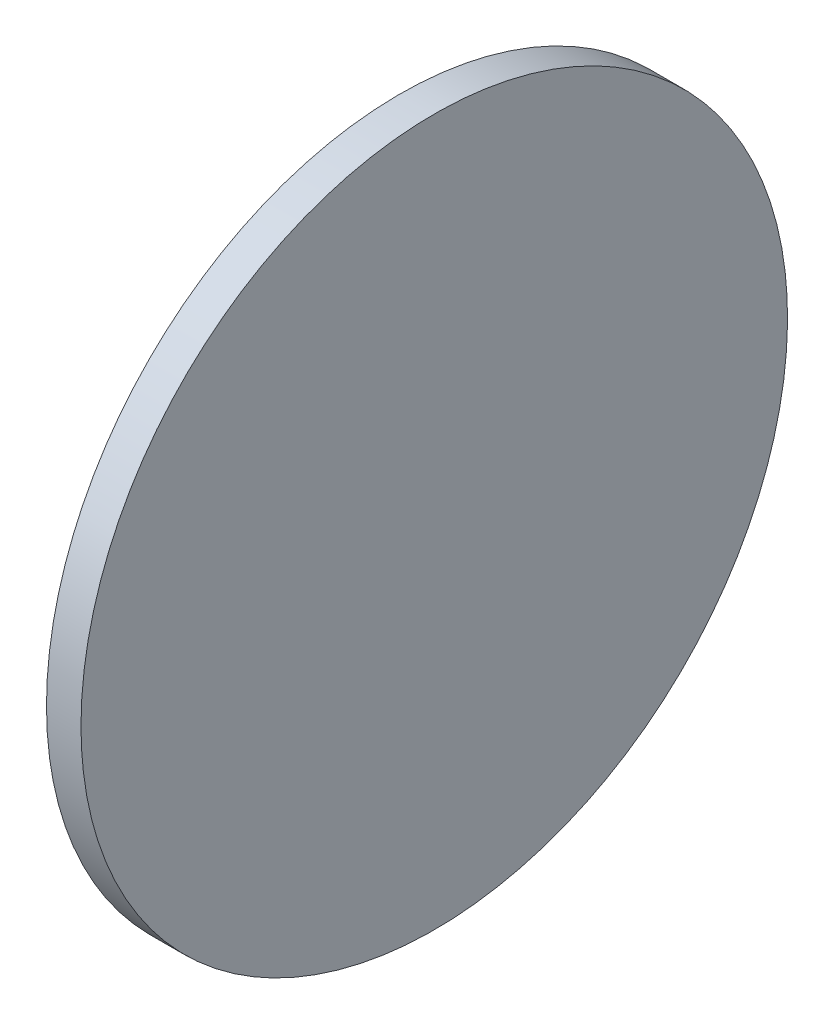
ISO-10303-21;
HEADER;
FILE_DESCRIPTION(('STEP AP214'),'2;1');
FILE_NAME('part.step','',(''),(''),'','','');
FILE_SCHEMA(('AUTOMOTIVE_DESIGN { 1 0 10303 214 1 1 1 1 }'));
ENDSEC;
DATA;
#1=APPLICATION_CONTEXT('core data for automotive mechanical design processes');
#2=APPLICATION_PROTOCOL_DEFINITION('international standard','automotive_design',2000,#1);
#3=PRODUCT_CONTEXT('',#1,'mechanical');
#4=PRODUCT('Part','Part','',(#3));
#5=PRODUCT_RELATED_PRODUCT_CATEGORY('part','',(#4));
#6=PRODUCT_DEFINITION_FORMATION('','',#4);
#7=PRODUCT_DEFINITION_CONTEXT('part definition',#1,'design');
#8=PRODUCT_DEFINITION('design','',#6,#7);
#9=PRODUCT_DEFINITION_SHAPE('','',#8);
#10=(LENGTH_UNIT() NAMED_UNIT(*) SI_UNIT(.MILLI.,.METRE.));
#11=(NAMED_UNIT(*) PLANE_ANGLE_UNIT() SI_UNIT($,.RADIAN.));
#12=(NAMED_UNIT(*) SI_UNIT($,.STERADIAN.) SOLID_ANGLE_UNIT());
#13=UNCERTAINTY_MEASURE_WITH_UNIT(LENGTH_MEASURE(1.E-05),#10,'distance_accuracy_value','');
#14=(GEOMETRIC_REPRESENTATION_CONTEXT(3) GLOBAL_UNCERTAINTY_ASSIGNED_CONTEXT((#13)) GLOBAL_UNIT_ASSIGNED_CONTEXT((#10,
#11,#12)) REPRESENTATION_CONTEXT('',''));
#15=CARTESIAN_POINT('',(0.,0.,0.));
#16=DIRECTION('',(0.,0.,1.));
#17=DIRECTION('',(1.,0.,0.));
#18=AXIS2_PLACEMENT_3D('',#15,#16,#17);
#19=CARTESIAN_POINT('',(-57.7008114631247,-10.1015554934087,30.2828427124814));
#20=CARTESIAN_POINT('',(-57.7008114631247,-9.42855059459681,30.2828427124814));
#21=CARTESIAN_POINT('',(-57.7008114631247,-8.08254079697294,30.150272318581));
#22=CARTESIAN_POINT('',(-57.7008114631247,-6.14111570304469,29.5613474548658));
#23=CARTESIAN_POINT('',(-57.7008114631247,-4.3518880892199,28.6049853705257));
#24=CARTESIAN_POINT('',(-57.7008114631247,-2.78361696928747,27.3179385241281));
#25=CARTESIAN_POINT('',(-57.7008114631247,-1.49657012288981,25.7496674041957));
#26=CARTESIAN_POINT('',(-57.7008114631247,-0.540208038549796,23.9604397903709));
#27=CARTESIAN_POINT('',(-57.7008114631247,0.0487168251654114,22.0190146964426));
#28=CARTESIAN_POINT('',(-57.7008114631247,0.247572416016112,20.0000000000068));
#29=CARTESIAN_POINT('',(-57.7008114631247,0.0487168251654121,17.980985303571));
#30=CARTESIAN_POINT('',(-57.7008114631247,-0.540208038549797,16.0395602096428));
#31=CARTESIAN_POINT('',(-57.7008114631247,-1.49657012288981,14.250332595818));
#32=CARTESIAN_POINT('',(-57.7008114631247,-2.78361696928747,12.6820614758856));
#33=CARTESIAN_POINT('',(-57.7008114631247,-4.3518880892199,11.3950146294879));
#34=CARTESIAN_POINT('',(-57.7008114631247,-6.14111570304469,10.4386525451479));
#35=CARTESIAN_POINT('',(-57.7008114631247,-8.08254079697294,9.84972768143268));
#36=CARTESIAN_POINT('',(-57.7008114631247,-10.1015554934087,9.65087209058198));
#37=CARTESIAN_POINT('',(-57.7008114631247,-12.1205701898445,9.84972768143268));
#38=CARTESIAN_POINT('',(-57.7008114631247,-14.0619952837728,10.4386525451479));
#39=CARTESIAN_POINT('',(-57.7008114631247,-15.8512228975976,11.3950146294879));
#40=CARTESIAN_POINT('',(-57.7008114631247,-17.41949401753,12.6820614758856));
#41=CARTESIAN_POINT('',(-57.7008114631247,-18.7065408639277,14.250332595818));
#42=CARTESIAN_POINT('',(-57.7008114631247,-19.6629029482677,16.0395602096428));
#43=CARTESIAN_POINT('',(-57.7008114631247,-20.2518278119829,17.980985303571));
#44=CARTESIAN_POINT('',(-57.7008114631247,-20.4506834028336,20.0000000000068));
#45=CARTESIAN_POINT('',(-57.7008114631247,-20.2518278119829,22.0190146964426));
#46=CARTESIAN_POINT('',(-57.7008114631247,-19.6629029482677,23.9604397903709));
#47=CARTESIAN_POINT('',(-57.7008114631247,-18.7065408639277,25.7496674041956));
#48=CARTESIAN_POINT('',(-57.7008114631247,-17.41949401753,27.3179385241281));
#49=CARTESIAN_POINT('',(-57.7008114631247,-15.8512228975976,28.6049853705257));
#50=CARTESIAN_POINT('',(-57.7008114631247,-14.0619952837728,29.5613474548658));
#51=CARTESIAN_POINT('',(-57.7008114631247,-12.1205701898445,30.150272318581));
#52=CARTESIAN_POINT('',(-57.7008114631247,-10.7745603922207,30.2828427124814));
#53=CARTESIAN_POINT('',(-57.7008114631247,-10.1015554934087,30.2828427124814));
#54=B_SPLINE_CURVE_WITH_KNOTS('',3,(#19,#20,#21,#22,#23,#24,#25,#26,#27,#28,#29,#30,#31,#32,#33,
#34,#35,#36,#37,#38,#39,#40,#41,#42,#43,#44,#45,#46,#47,#48,#49,#50,#51,#52,#53),.UNSPECIFIED.,
.T.,.F.,(4,1,1,1,1,1,1,1,1,1,1,1,1,1,1,1,1,1,1,1,1,1,1,1,1,1,1,1,1,1,1,1,4),(0.,0.03125,0.0625,
0.09375,0.125,0.15625,0.1875,0.21875,0.25,0.28125,0.3125,0.34375,0.375,0.40625,0.4375,0.46875,
0.5,0.53125,0.5625,0.59375,0.625,0.65625,0.6875,0.71875,0.75,0.78125,0.8125,0.84375,0.875,
0.90625,0.9375,0.96875,1.),.UNSPECIFIED.);
#55=DIRECTION('',(-1.,0.,0.));
#56=VECTOR('',#55,1.);
#57=SURFACE_OF_LINEAR_EXTRUSION('',#54,#56);
#58=CARTESIAN_POINT('',(-57.7008114631247,-10.1015554934087,30.2828427124814));
#59=CARTESIAN_POINT('',(-57.7008114631247,-9.42855059459681,30.2828427124814));
#60=CARTESIAN_POINT('',(-57.7008114631246,-8.08254079697294,30.150272318581));
#61=CARTESIAN_POINT('',(-57.7008114631247,-6.14111570304469,29.5613474548658));
#62=CARTESIAN_POINT('',(-57.7008114631247,-4.3518880892199,28.6049853705257));
#63=CARTESIAN_POINT('',(-57.7008114631247,-2.78361696928747,27.3179385241281));
#64=CARTESIAN_POINT('',(-57.7008114631247,-1.49657012288981,25.7496674041957));
#65=CARTESIAN_POINT('',(-57.7008114631247,-0.540208038549796,23.9604397903709));
#66=CARTESIAN_POINT('',(-57.7008114631247,0.0487168251654114,22.0190146964426));
#67=CARTESIAN_POINT('',(-57.7008114631247,0.247572416016112,20.0000000000068));
#68=CARTESIAN_POINT('',(-57.7008114631247,0.0487168251654121,17.980985303571));
#69=CARTESIAN_POINT('',(-57.7008114631247,-0.540208038549797,16.0395602096428));
#70=CARTESIAN_POINT('',(-57.7008114631247,-1.49657012288981,14.250332595818));
#71=CARTESIAN_POINT('',(-57.7008114631247,-2.78361696928747,12.6820614758856));
#72=CARTESIAN_POINT('',(-57.7008114631247,-4.3518880892199,11.3950146294879));
#73=CARTESIAN_POINT('',(-57.7008114631247,-6.14111570304469,10.4386525451479));
#74=CARTESIAN_POINT('',(-57.7008114631247,-8.08254079697294,9.84972768143268));
#75=CARTESIAN_POINT('',(-57.7008114631247,-10.1015554934087,9.65087209058198));
#76=CARTESIAN_POINT('',(-57.7008114631247,-12.1205701898445,9.84972768143268));
#77=CARTESIAN_POINT('',(-57.7008114631247,-14.0619952837728,10.4386525451479));
#78=CARTESIAN_POINT('',(-57.7008114631247,-15.8512228975976,11.3950146294879));
#79=CARTESIAN_POINT('',(-57.7008114631247,-17.41949401753,12.6820614758856));
#80=CARTESIAN_POINT('',(-57.7008114631247,-18.7065408639277,14.250332595818));
#81=CARTESIAN_POINT('',(-57.7008114631247,-19.6629029482677,16.0395602096428));
#82=CARTESIAN_POINT('',(-57.7008114631247,-20.2518278119829,17.980985303571));
#83=CARTESIAN_POINT('',(-57.7008114631246,-20.4506834028336,20.0000000000068));
#84=CARTESIAN_POINT('',(-57.7008114631247,-20.2518278119829,22.0190146964426));
#85=CARTESIAN_POINT('',(-57.7008114631247,-19.6629029482677,23.9604397903709));
#86=CARTESIAN_POINT('',(-57.7008114631247,-18.7065408639277,25.7496674041956));
#87=CARTESIAN_POINT('',(-57.7008114631247,-17.41949401753,27.3179385241281));
#88=CARTESIAN_POINT('',(-57.7008114631247,-15.8512228975976,28.6049853705257));
#89=CARTESIAN_POINT('',(-57.7008114631247,-14.0619952837728,29.5613474548658));
#90=CARTESIAN_POINT('',(-57.7008114631247,-12.1205701898445,30.150272318581));
#91=CARTESIAN_POINT('',(-57.7008114631247,-10.7745603922207,30.2828427124814));
#92=CARTESIAN_POINT('',(-57.7008114631247,-10.1015554934087,30.2828427124814));
#93=B_SPLINE_CURVE_WITH_KNOTS('',3,(#58,#59,#60,#61,#62,#63,#64,#65,#66,#67,#68,#69,#70,#71,#72,
#73,#74,#75,#76,#77,#78,#79,#80,#81,#82,#83,#84,#85,#86,#87,#88,#89,#90,#91,#92),.UNSPECIFIED.,
.T.,.F.,(4,1,1,1,1,1,1,1,1,1,1,1,1,1,1,1,1,1,1,1,1,1,1,1,1,1,1,1,1,1,1,1,4),(0.,0.03125,0.0625,
0.09375,0.125,0.15625,0.1875,0.21875,0.25,0.28125,0.3125,0.34375,0.375,0.40625,0.4375,0.46875,
0.5,0.53125,0.5625,0.59375,0.625,0.65625,0.6875,0.71875,0.75,0.78125,0.8125,0.84375,0.875,
0.90625,0.9375,0.96875,1.),.UNSPECIFIED.);
#94=CARTESIAN_POINT('',(-57.7008114631247,-10.1015554934087,30.2828427124814));
#95=VERTEX_POINT('',#94);
#96=EDGE_CURVE('E9',#95,#95,#93,.T.);
#97=ORIENTED_EDGE('',*,*,#96,.T.);
#98=EDGE_LOOP('',(#97));
#99=FACE_BOUND('',#98,.T.);
#100=CARTESIAN_POINT('',(-58.7052049368191,-10.1015554934087,30.2828427124814));
#101=CARTESIAN_POINT('',(-58.7052049368191,-10.2698077512351,30.2828426775823));
#102=CARTESIAN_POINT('',(-58.7052049368191,-10.438058784543,30.2786998381964));
#103=CARTESIAN_POINT('',(-58.7052049368191,-10.7741567433599,30.2621683753116));
#104=CARTESIAN_POINT('',(-58.7052049368191,-10.9420036657198,30.2497796877606));
#105=CARTESIAN_POINT('',(-58.7052049368191,-11.276889117429,30.2167963546452));
#106=CARTESIAN_POINT('',(-58.7052049368191,-11.4439276467783,30.1962017090808));
#107=CARTESIAN_POINT('',(-58.7052049368191,-11.7767930540147,30.1468460112992));
#108=CARTESIAN_POINT('',(-58.7052049368191,-11.9426199413037,30.1180850225185));
#109=CARTESIAN_POINT('',(-58.7052049368191,-12.2726572375495,30.0524365236886));
#110=CARTESIAN_POINT('',(-58.7052049368191,-12.4368676465063,30.0155490136396));
#111=CARTESIAN_POINT('',(-58.7052049368191,-12.7632828148587,29.9337656470033));
#112=CARTESIAN_POINT('',(-58.7052049368191,-12.9254875586649,29.8888697282104));
#113=CARTESIAN_POINT('',(-58.7052049368191,-13.247503453177,29.7911872746742));
#114=CARTESIAN_POINT('',(-58.7052049368191,-13.407314603883,29.7384007399309));
#115=CARTESIAN_POINT('',(-58.7052049368191,-13.7241553029591,29.6250545719401));
#116=CARTESIAN_POINT('',(-58.7052049368191,-13.8811848729266,29.5644949990759));
#117=CARTESIAN_POINT('',(-58.7052049368191,-14.1920732012511,29.4357208371141));
#118=CARTESIAN_POINT('',(-58.7052049368191,-14.3459319596082,29.3675062480165));
#119=CARTESIAN_POINT('',(-58.7052049368191,-14.6501200105826,29.2236138850579));
#120=CARTESIAN_POINT('',(-58.7052049368191,-14.8004492757742,29.1479360532279));
#121=CARTESIAN_POINT('',(-58.7052049368191,-15.0972208233463,28.9893083562185));
#122=CARTESIAN_POINT('',(-58.7052049368191,-15.2436631057269,28.9063584910392));
#123=CARTESIAN_POINT('',(-58.7052049368191,-15.5323030593363,28.733377683839));
#124=CARTESIAN_POINT('',(-58.7052049368191,-15.6745007635276,28.6433467968277));
#125=CARTESIAN_POINT('',(-58.7052049368191,-15.9542928670367,28.4563956902046));
#126=CARTESIAN_POINT('',(-58.7052049368191,-16.0918872663545,28.3594754705927));
#127=CARTESIAN_POINT('',(-58.7052049368191,-16.3621584218092,28.15900381422));
#128=CARTESIAN_POINT('',(-58.7052049368191,-16.4948351397382,28.0554523259545));
#129=CARTESIAN_POINT('',(-58.7052049368191,-16.7549575767466,27.841975358883));
#130=CARTESIAN_POINT('',(-58.7052049368191,-16.8824032958261,27.7320498800771));
#131=CARTESIAN_POINT('',(-58.7052049368191,-17.1317502322838,27.5060819890863));
#132=CARTESIAN_POINT('',(-58.7052049368191,-17.2536514927231,27.3900396244234));
#133=CARTESIAN_POINT('',(-58.7052049368191,-17.4915951178253,27.1520959993212));
#134=CARTESIAN_POINT('',(-58.7052049368191,-17.6076374824882,27.0301947388819));
#135=CARTESIAN_POINT('',(-58.7052049368191,-17.833605373479,26.7808478024241));
#136=CARTESIAN_POINT('',(-58.7052049368191,-17.9435308522849,26.6534020833447));
#137=CARTESIAN_POINT('',(-58.7052049368191,-18.1570078193564,26.3932796463363));
#138=CARTESIAN_POINT('',(-58.7052049368191,-18.2605593076219,26.2606029284073));
#139=CARTESIAN_POINT('',(-58.7052049368191,-18.4610309639946,25.9903317729525));
#140=CARTESIAN_POINT('',(-58.7052049368191,-18.5579511836065,25.8527373736347));
#141=CARTESIAN_POINT('',(-58.7052049368191,-18.7449022902296,25.5729452701258));
#142=CARTESIAN_POINT('',(-58.7052049368191,-18.8349331772409,25.4307475659347));
#143=CARTESIAN_POINT('',(-58.7052049368191,-19.0079139844411,25.1421076123246));
#144=CARTESIAN_POINT('',(-58.7052049368191,-19.0908638496205,24.9956653299431));
#145=CARTESIAN_POINT('',(-58.7052049368191,-19.2494915466297,24.6988937823736));
#146=CARTESIAN_POINT('',(-58.7052049368191,-19.3251693784596,24.5485645171857));
#147=CARTESIAN_POINT('',(-58.7052049368191,-19.4690617414186,24.2443764662012));
#148=CARTESIAN_POINT('',(-58.7052049368191,-19.5372763305169,24.0905177078304));
#149=CARTESIAN_POINT('',(-58.7052049368191,-19.6660504924769,23.7796293795435));
#150=CARTESIAN_POINT('',(-58.7052049368191,-19.7266100653386,23.6225998096273));
#151=CARTESIAN_POINT('',(-58.7052049368191,-19.8399562333363,23.305759110411));
#152=CARTESIAN_POINT('',(-58.7052049368191,-19.8927427680891,23.1459479595134));
#153=CARTESIAN_POINT('',(-58.7052049368191,-19.9904252215994,22.8239320655246));
#154=CARTESIAN_POINT('',(-58.7052049368191,-20.035321140357,22.6617273224333));
#155=CARTESIAN_POINT('',(-58.7052049368191,-20.1171045070897,22.3353121521278));
#156=CARTESIAN_POINT('',(-58.7052049368191,-20.1539920172704,22.1711017405033));
#157=CARTESIAN_POINT('',(-58.7052049368191,-20.2196405157405,21.8410644515461));
#158=CARTESIAN_POINT('',(-58.7052049368191,-20.2484015040298,21.6752375742135));
#159=CARTESIAN_POINT('',(-58.7052049368191,-20.2977572031541,21.3423721397755));
#160=CARTESIAN_POINT('',(-58.7052049368191,-20.3183518505527,21.1753335732679));
#161=CARTESIAN_POINT('',(-58.7052049368191,-20.3513351786568,20.8404482230771));
#162=CARTESIAN_POINT('',(-58.7052049368191,-20.3637238593622,20.6726014393939));
#163=CARTESIAN_POINT('',(-58.7052049368191,-20.3802553409496,20.3365031017066));
#164=CARTESIAN_POINT('',(-58.7052049368191,-20.3843982058833,20.1682515508567));
#165=CARTESIAN_POINT('',(-58.7052049368191,-20.3843982058833,19.8317484491569));
#166=CARTESIAN_POINT('',(-58.7052049368191,-20.3802553409496,19.6634968983071));
#167=CARTESIAN_POINT('',(-58.7052049368191,-20.3637238593622,19.3273985606197));
#168=CARTESIAN_POINT('',(-58.7052049368191,-20.3513351786568,19.1595517769366));
#169=CARTESIAN_POINT('',(-58.7052049368191,-20.3183518505527,18.8246664267458));
#170=CARTESIAN_POINT('',(-58.7052049368191,-20.2977572031541,18.6576278602381));
#171=CARTESIAN_POINT('',(-58.7052049368191,-20.2484015040298,18.3247624258001));
#172=CARTESIAN_POINT('',(-58.7052049368191,-20.2196405157405,18.1589355484675));
#173=CARTESIAN_POINT('',(-58.7052049368191,-20.1539920172704,17.8288982595104));
#174=CARTESIAN_POINT('',(-58.7052049368191,-20.1171045070897,17.6646878478858));
#175=CARTESIAN_POINT('',(-58.7052049368191,-20.035321140357,17.3382726775803));
#176=CARTESIAN_POINT('',(-58.7052049368191,-19.9904252215994,17.176067934489));
#177=CARTESIAN_POINT('',(-58.7052049368191,-19.8927427680891,16.8540520405002));
#178=CARTESIAN_POINT('',(-58.7052049368191,-19.8399562333363,16.6942408896027));
#179=CARTESIAN_POINT('',(-58.7052049368191,-19.7266100653386,16.3774001903863));
#180=CARTESIAN_POINT('',(-58.7052049368191,-19.6660504924769,16.2203706204702));
#181=CARTESIAN_POINT('',(-58.7052049368191,-19.5372763305169,15.9094822921832));
#182=CARTESIAN_POINT('',(-58.7052049368191,-19.4690617414186,15.7556235338124));
#183=CARTESIAN_POINT('',(-58.7052049368191,-19.3251693784596,15.4514354828279));
#184=CARTESIAN_POINT('',(-58.7052049368191,-19.2494915466297,15.30110621764));
#185=CARTESIAN_POINT('',(-58.7052049368191,-19.0908638496205,15.0043346700706));
#186=CARTESIAN_POINT('',(-58.7052049368191,-19.0079139844411,14.857892387689));
#187=CARTESIAN_POINT('',(-58.7052049368191,-18.8349331772409,14.5692524340789));
#188=CARTESIAN_POINT('',(-58.7052049368191,-18.7449022902296,14.4270547298878));
#189=CARTESIAN_POINT('',(-58.7052049368191,-18.5579511836065,14.1472626263789));
#190=CARTESIAN_POINT('',(-58.7052049368191,-18.4610309639946,14.0096682270611));
#191=CARTESIAN_POINT('',(-58.7052049368191,-18.2605593076219,13.7393970716063));
#192=CARTESIAN_POINT('',(-58.7052049368191,-18.1570078193564,13.6067203536774));
#193=CARTESIAN_POINT('',(-58.7052049368191,-17.9435308522849,13.346597916669));
#194=CARTESIAN_POINT('',(-58.7052049368191,-17.833605373479,13.2191521975895));
#195=CARTESIAN_POINT('',(-58.7052049368191,-17.6076374824882,12.9698052611318));
#196=CARTESIAN_POINT('',(-58.7052049368191,-17.4915951178253,12.8479040006925));
#197=CARTESIAN_POINT('',(-58.7052049368191,-17.2536514927231,12.6099603755902));
#198=CARTESIAN_POINT('',(-58.7052049368191,-17.1317502322838,12.4939180109274));
#199=CARTESIAN_POINT('',(-58.7052049368191,-16.882403295826,12.2679501199366));
#200=CARTESIAN_POINT('',(-58.7052049368191,-16.7549575767466,12.1580246411306));
#201=CARTESIAN_POINT('',(-58.7052049368191,-16.4948351397382,11.9445476740592));
#202=CARTESIAN_POINT('',(-58.7052049368191,-16.3621584218092,11.8409961857937));
#203=CARTESIAN_POINT('',(-58.7052049368191,-16.0918872663544,11.640524529421));
#204=CARTESIAN_POINT('',(-58.7052049368191,-15.9542928670366,11.5436043098091));
#205=CARTESIAN_POINT('',(-58.7052049368191,-15.6745007635277,11.3566532031859));
#206=CARTESIAN_POINT('',(-58.7052049368191,-15.5323030593366,11.2666223161747));
#207=CARTESIAN_POINT('',(-58.7052049368191,-15.2436631057266,11.0936415089744));
#208=CARTESIAN_POINT('',(-58.7052049368191,-15.097220823345,11.0106916437951));
#209=CARTESIAN_POINT('',(-58.7052049368191,-14.8004492757755,10.8520639467858));
#210=CARTESIAN_POINT('',(-58.7052049368191,-14.6501200105876,10.776386114956));
#211=CARTESIAN_POINT('',(-58.7052049368191,-14.3459319596032,10.6324937519969));
#212=CARTESIAN_POINT('',(-58.7052049368191,-14.1920732012324,10.5642791628987));
#213=CARTESIAN_POINT('',(-58.7052049368191,-13.8811848729454,10.4355050009387));
#214=CARTESIAN_POINT('',(-58.7052049368191,-13.7241553030292,10.374945428077));
#215=CARTESIAN_POINT('',(-58.7052049368191,-13.4073146038129,10.2615992600793));
#216=CARTESIAN_POINT('',(-58.7052049368191,-13.2475034529153,10.2088127253265));
#217=CARTESIAN_POINT('',(-58.7052049368191,-12.9254875589265,10.1111302718161));
#218=CARTESIAN_POINT('',(-58.7052049368191,-12.7632828158352,10.0662343530585));
#219=CARTESIAN_POINT('',(-58.7052049368191,-12.4368676455298,9.98445098632588));
#220=CARTESIAN_POINT('',(-58.7052049368191,-12.2726572339052,9.94756347614512));
#221=CARTESIAN_POINT('',(-58.7052049368191,-11.942619944948,9.88191497767508));
#222=CARTESIAN_POINT('',(-58.7052049368191,-11.7767930676154,9.85315398938581));
#223=CARTESIAN_POINT('',(-58.7052049368191,-11.4439276331774,9.80379829026144));
#224=CARTESIAN_POINT('',(-58.7052049368191,-11.2768890666698,9.78320364286281));
#225=CARTESIAN_POINT('',(-58.7052049368191,-10.942003716479,9.75022031475877));
#226=CARTESIAN_POINT('',(-58.7052049368191,-10.7741569327958,9.73783163405335));
#227=CARTESIAN_POINT('',(-58.7052049368191,-10.4380585951085,9.72130015246599));
#228=CARTESIAN_POINT('',(-58.7052049368191,-10.2698070442586,9.71715728753221));
#229=CARTESIAN_POINT('',(-58.7052049368191,-9.93330394255885,9.71715728753221));
#230=CARTESIAN_POINT('',(-58.7052049368191,-9.76505239170897,9.72130015246599));
#231=CARTESIAN_POINT('',(-58.7052049368191,-9.42895405402162,9.73783163405335));
#232=CARTESIAN_POINT('',(-58.7052049368191,-9.26110727033847,9.75022031475876));
#233=CARTESIAN_POINT('',(-58.7052049368191,-8.92622192014769,9.78320364286281));
#234=CARTESIAN_POINT('',(-58.7052049368191,-8.75918335364005,9.80379829026144));
#235=CARTESIAN_POINT('',(-58.7052049368191,-8.42631791920202,9.85315398938581));
#236=CARTESIAN_POINT('',(-58.7052049368191,-8.26049104186944,9.88191497767508));
#237=CARTESIAN_POINT('',(-58.7052049368191,-7.93045375291229,9.94756347614511));
#238=CARTESIAN_POINT('',(-58.7052049368191,-7.7662433412877,9.98445098632587));
#239=CARTESIAN_POINT('',(-58.7052049368191,-7.43982817098224,10.0662343530585));
#240=CARTESIAN_POINT('',(-58.7052049368191,-7.27762342789096,10.1111302718161));
#241=CARTESIAN_POINT('',(-58.7052049368191,-6.95560753390214,10.2088127253265));
#242=CARTESIAN_POINT('',(-58.7052049368191,-6.7957963830046,10.2615992600792));
#243=CARTESIAN_POINT('',(-58.7052049368191,-6.47895568378826,10.374945428077));
#244=CARTESIAN_POINT('',(-58.7052049368191,-6.32192611387209,10.4355050009387));
#245=CARTESIAN_POINT('',(-58.7052049368191,-6.01103778558511,10.5642791628987));
#246=CARTESIAN_POINT('',(-58.7052049368191,-5.85717902721431,10.6324937519969));
#247=CARTESIAN_POINT('',(-58.7052049368191,-5.55299097622983,10.776386114956));
#248=CARTESIAN_POINT('',(-58.7052049368191,-5.40266171104194,10.8520639467858));
#249=CARTESIAN_POINT('',(-58.7052049368191,-5.10589016347248,11.0106916437951));
#250=CARTESIAN_POINT('',(-58.7052049368191,-4.95944788109091,11.0936415089744));
#251=CARTESIAN_POINT('',(-58.7052049368191,-4.67080792748083,11.2666223161747));
#252=CARTESIAN_POINT('',(-58.7052049368191,-4.52861022328975,11.3566532031859));
#253=CARTESIAN_POINT('',(-58.7052049368191,-4.24881811978084,11.5436043098091));
#254=CARTESIAN_POINT('',(-58.7052049368191,-4.11122372046302,11.640524529421));
#255=CARTESIAN_POINT('',(-58.7052049368191,-3.84095256500824,11.8409961857937));
#256=CARTESIAN_POINT('',(-58.7052049368191,-3.70827584707929,11.9445476740592));
#257=CARTESIAN_POINT('',(-58.7052049368191,-3.44815341007088,12.1580246411306));
#258=CARTESIAN_POINT('',(-58.7052049368191,-3.32070769099142,12.2679501199366));
#259=CARTESIAN_POINT('',(-58.7052049368191,-3.07136075453369,12.4939180109274));
#260=CARTESIAN_POINT('',(-58.7052049368191,-2.94945949409437,12.6099603755902));
#261=CARTESIAN_POINT('',(-58.7052049368191,-2.71151586899216,12.8479040006925));
#262=CARTESIAN_POINT('',(-58.7052049368191,-2.59547350432927,12.9698052611318));
#263=CARTESIAN_POINT('',(-58.7052049368191,-2.3695056133385,13.2191521975895));
#264=CARTESIAN_POINT('',(-58.7052049368191,-2.25958013453255,13.346597916669));
#265=CARTESIAN_POINT('',(-58.7052049368191,-2.04610316746108,13.6067203536774));
#266=CARTESIAN_POINT('',(-58.7052049368191,-1.94255167919557,13.7393970716063));
#267=CARTESIAN_POINT('',(-58.7052049368191,-1.74208002282288,14.0096682270611));
#268=CARTESIAN_POINT('',(-58.7052049368191,-1.64515980321099,14.1472626263789));
#269=CARTESIAN_POINT('',(-58.7052049368191,-1.45820869658784,14.4270547298878));
#270=CARTESIAN_POINT('',(-58.7052049368191,-1.36817780957657,14.5692524340789));
#271=CARTESIAN_POINT('',(-58.7052049368191,-1.19519700237634,14.857892387689));
#272=CARTESIAN_POINT('',(-58.7052049368191,-1.11224713719697,15.0043346700706));
#273=CARTESIAN_POINT('',(-58.7052049368191,-0.95361944018774,15.30110621764));
#274=CARTESIAN_POINT('',(-58.7052049368191,-0.877941608357881,15.4514354828279));
#275=CARTESIAN_POINT('',(-58.7052049368191,-0.734049245398835,15.7556235338124));
#276=CARTESIAN_POINT('',(-58.7052049368191,-0.66583465630058,15.9094822921832));
#277=CARTESIAN_POINT('',(-58.7052049368191,-0.537060494340616,16.2203706204702));
#278=CARTESIAN_POINT('',(-58.7052049368191,-0.476500921478905,16.3774001903863));
#279=CARTESIAN_POINT('',(-58.7052049368191,-0.363154753481161,16.6942408896027));
#280=CARTESIAN_POINT('',(-58.7052049368191,-0.310368218728401,16.8540520405002));
#281=CARTESIAN_POINT('',(-58.7052049368191,-0.212685765218039,17.176067934489));
#282=CARTESIAN_POINT('',(-58.7052049368191,-0.167789846460436,17.3382726775803));
#283=CARTESIAN_POINT('',(-58.7052049368191,-0.0860064797277837,17.6646878478858));
#284=CARTESIAN_POINT('',(-58.7052049368191,-0.0491189695470225,17.8288982595104));
#285=CARTESIAN_POINT('',(-58.7052049368191,0.0165295289230105,18.1589355484675));
#286=CARTESIAN_POINT('',(-58.7052049368191,0.0452905172122823,18.3247624258001));
#287=CARTESIAN_POINT('',(-58.7052049368191,0.09464621633665,18.6576278602381));
#288=CARTESIAN_POINT('',(-58.7052049368191,0.115240863735283,18.8246664267458));
#289=CARTESIAN_POINT('',(-58.7052049368191,0.148224191839329,19.1595517769366));
#290=CARTESIAN_POINT('',(-58.7052049368191,0.160612872544742,19.3273985606197));
#291=CARTESIAN_POINT('',(-58.7052049368191,0.177144354132105,19.6634968983071));
#292=CARTESIAN_POINT('',(-58.7052049368191,0.181287219065879,19.8317484491569));
#293=CARTESIAN_POINT('',(-58.7052049368191,0.181287219065879,20.1682515508567));
#294=CARTESIAN_POINT('',(-58.7052049368191,0.177144354132104,20.3365031017066));
#295=CARTESIAN_POINT('',(-58.7052049368191,0.160612872544742,20.6726014393939));
#296=CARTESIAN_POINT('',(-58.7052049368191,0.148224191839329,20.8404482230771));
#297=CARTESIAN_POINT('',(-58.7052049368191,0.115240863735282,21.1753335732679));
#298=CARTESIAN_POINT('',(-58.7052049368191,0.09464621633665,21.3423721397755));
#299=CARTESIAN_POINT('',(-58.7052049368191,0.0452905172122823,21.6752375742135));
#300=CARTESIAN_POINT('',(-58.7052049368191,0.0165295289230106,21.8410644515461));
#301=CARTESIAN_POINT('',(-58.7052049368191,-0.0491189695470226,22.1711017405033));
#302=CARTESIAN_POINT('',(-58.7052049368191,-0.0860064797277839,22.3353121521279));
#303=CARTESIAN_POINT('',(-58.7052049368191,-0.167789846460436,22.6617273224333));
#304=CARTESIAN_POINT('',(-58.7052049368191,-0.212685765218038,22.8239320655246));
#305=CARTESIAN_POINT('',(-58.7052049368191,-0.3103682187284,23.1459479595134));
#306=CARTESIAN_POINT('',(-58.7052049368191,-0.363154753481161,23.305759110411));
#307=CARTESIAN_POINT('',(-58.7052049368191,-0.476500921478904,23.6225998096273));
#308=CARTESIAN_POINT('',(-58.7052049368191,-0.537060494340613,23.7796293795435));
#309=CARTESIAN_POINT('',(-58.7052049368191,-0.665834656300578,24.0905177078305));
#310=CARTESIAN_POINT('',(-58.7052049368191,-0.734049245398834,24.2443764662013));
#311=CARTESIAN_POINT('',(-58.7052049368191,-0.87794160835788,24.5485645171857));
#312=CARTESIAN_POINT('',(-58.7052049368191,-0.953619440187737,24.6988937823736));
#313=CARTESIAN_POINT('',(-58.7052049368191,-1.11224713719696,24.9956653299431));
#314=CARTESIAN_POINT('',(-58.7052049368191,-1.19519700237633,25.1421076123247));
#315=CARTESIAN_POINT('',(-58.7052049368191,-1.36817780957656,25.4307475659347));
#316=CARTESIAN_POINT('',(-58.7052049368191,-1.45820869658784,25.5729452701258));
#317=CARTESIAN_POINT('',(-58.7052049368191,-1.64515980321099,25.8527373736347));
#318=CARTESIAN_POINT('',(-58.7052049368191,-1.74208002282288,25.9903317729525));
#319=CARTESIAN_POINT('',(-58.7052049368191,-1.94255167919557,26.2606029284073));
#320=CARTESIAN_POINT('',(-58.7052049368191,-2.04610316746108,26.3932796463363));
#321=CARTESIAN_POINT('',(-58.7052049368191,-2.25958013453254,26.6534020833447));
#322=CARTESIAN_POINT('',(-58.7052049368191,-2.3695056133385,26.7808478024241));
#323=CARTESIAN_POINT('',(-58.7052049368191,-2.59547350432927,27.0301947388819));
#324=CARTESIAN_POINT('',(-58.7052049368191,-2.71151586899216,27.1520959993212));
#325=CARTESIAN_POINT('',(-58.7052049368191,-2.94945949409437,27.3900396244234));
#326=CARTESIAN_POINT('',(-58.7052049368191,-3.07136075453369,27.5060819890863));
#327=CARTESIAN_POINT('',(-58.7052049368191,-3.32070769099142,27.7320498800771));
#328=CARTESIAN_POINT('',(-58.7052049368191,-3.44815341007087,27.841975358883));
#329=CARTESIAN_POINT('',(-58.7052049368191,-3.7082758470793,28.0554523259545));
#330=CARTESIAN_POINT('',(-58.7052049368191,-3.84095256500826,28.15900381422));
#331=CARTESIAN_POINT('',(-58.7052049368191,-4.11122372046299,28.3594754705927));
#332=CARTESIAN_POINT('',(-58.7052049368191,-4.24881811978074,28.4563956902046));
#333=CARTESIAN_POINT('',(-58.7052049368191,-4.52861022328985,28.6433467968277));
#334=CARTESIAN_POINT('',(-58.7052049368191,-4.67080792748119,28.733377683839));
#335=CARTESIAN_POINT('',(-58.7052049368191,-4.95944788109055,28.9063584910392));
#336=CARTESIAN_POINT('',(-58.7052049368191,-5.10589016347113,28.9893083562185));
#337=CARTESIAN_POINT('',(-58.7052049368191,-5.40266171104329,29.1479360532279));
#338=CARTESIAN_POINT('',(-58.7052049368191,-5.55299097623486,29.2236138850579));
#339=CARTESIAN_POINT('',(-58.7052049368191,-5.85717902720927,29.3675062480165));
#340=CARTESIAN_POINT('',(-58.7052049368191,-6.01103778556633,29.4357208371141));
#341=CARTESIAN_POINT('',(-58.7052049368191,-6.32192611389087,29.5644949990759));
#342=CARTESIAN_POINT('',(-58.7052049368191,-6.47895568385837,29.6250545719401));
#343=CARTESIAN_POINT('',(-58.7052049368191,-6.79579638293449,29.7384007399309));
#344=CARTESIAN_POINT('',(-58.7052049368191,-6.95560753364048,29.7911872746742));
#345=CARTESIAN_POINT('',(-58.7052049368191,-7.27762342815261,29.8888697282104));
#346=CARTESIAN_POINT('',(-58.7052049368191,-7.43982817195874,29.9337656470033));
#347=CARTESIAN_POINT('',(-58.7052049368191,-7.76624334031121,30.0155490136396));
#348=CARTESIAN_POINT('',(-58.7052049368191,-7.93045374926798,30.0524365236886));
#349=CARTESIAN_POINT('',(-58.7052049368191,-8.26049104551375,30.1180850225185));
#350=CARTESIAN_POINT('',(-58.7052049368191,-8.42631793280275,30.1468460112992));
#351=CARTESIAN_POINT('',(-58.7052049368191,-8.75918334003921,30.1962017090808));
#352=CARTESIAN_POINT('',(-58.7052049368191,-8.92622186938849,30.2167963546452));
#353=CARTESIAN_POINT('',(-58.7052049368191,-9.26110732109766,30.2497796877606));
#354=CARTESIAN_POINT('',(-58.7052049368191,-9.42895424345756,30.2621683753116));
#355=CARTESIAN_POINT('',(-58.7052049368191,-9.76505220227451,30.2786998381964));
#356=CARTESIAN_POINT('',(-58.7052049368191,-9.93330323558236,30.2828426775823));
#357=CARTESIAN_POINT('',(-58.7052049368191,-10.1015554934087,30.2828427124814));
#358=B_SPLINE_CURVE_WITH_KNOTS('',3,(#100,#101,#102,#103,#104,#105,#106,#107,#108,#109,#110,
#111,#112,#113,#114,#115,#116,#117,#118,#119,#120,#121,#122,#123,#124,#125,#126,#127,#128,#129,
#130,#131,#132,#133,#134,#135,#136,#137,#138,#139,#140,#141,#142,#143,#144,#145,#146,#147,#148,
#149,#150,#151,#152,#153,#154,#155,#156,#157,#158,#159,#160,#161,#162,#163,#164,#165,#166,#167,
#168,#169,#170,#171,#172,#173,#174,#175,#176,#177,#178,#179,#180,#181,#182,#183,#184,#185,#186,
#187,#188,#189,#190,#191,#192,#193,#194,#195,#196,#197,#198,#199,#200,#201,#202,#203,#204,#205,
#206,#207,#208,#209,#210,#211,#212,#213,#214,#215,#216,#217,#218,#219,#220,#221,#222,#223,#224,
#225,#226,#227,#228,#229,#230,#231,#232,#233,#234,#235,#236,#237,#238,#239,#240,#241,#242,#243,
#244,#245,#246,#247,#248,#249,#250,#251,#252,#253,#254,#255,#256,#257,#258,#259,#260,#261,#262,
#263,#264,#265,#266,#267,#268,#269,#270,#271,#272,#273,#274,#275,#276,#277,#278,#279,#280,#281,
#282,#283,#284,#285,#286,#287,#288,#289,#290,#291,#292,#293,#294,#295,#296,#297,#298,#299,#300,
#301,#302,#303,#304,#305,#306,#307,#308,#309,#310,#311,#312,#313,#314,#315,#316,#317,#318,#319,
#320,#321,#322,#323,#324,#325,#326,#327,#328,#329,#330,#331,#332,#333,#334,#335,#336,#337,#338,
#339,#340,#341,#342,#343,#344,#345,#346,#347,#348,#349,#350,#351,#352,#353,#354,#355,#356,#357),
.UNSPECIFIED.,.F.,.F.,(4,2,2,2,2,2,2,2,2,2,2,2,2,2,2,2,2,2,2,2,2,2,2,2,2,2,2,2,2,2,2,2,2,2,2,2,
2,2,2,2,2,2,2,2,2,2,2,2,2,2,2,2,2,2,2,2,2,2,2,2,2,2,2,2,2,2,2,2,2,2,2,2,2,2,2,2,2,2,2,2,2,2,2,2,
2,2,2,2,2,2,2,2,2,2,2,2,2,2,2,2,2,2,2,2,2,2,2,2,2,2,2,2,2,2,2,2,2,2,2,2,2,2,2,2,2,2,2,2,4),(0.,
0.504704178481684,1.00941227744886,1.51412037641604,2.01882455489772,2.52352873337941,
3.02823683234659,3.53294493131377,4.03764910979545,4.54235328827714,5.04706138724432,
5.55176948621149,6.05647366469318,6.56117784317486,7.06588594214204,7.57059404110922,
8.0752982195909,8.58000239807259,9.08471049703977,9.58941859600694,10.0941227744886,
10.5988269529703,11.1035350519375,11.6082431509047,12.1129473293864,12.617651507868,
13.1223596068352,13.6270677058024,14.1317718842841,14.6364760627658,15.1411841617329,
15.6458922607001,16.1505964391818,16.6553006176635,17.1600087166307,17.6647168155979,
18.1694209940795,18.6741251725612,19.1788332715284,19.6835413704956,20.1882455489773,
20.6929497274589,21.1976578264261,21.7023659253933,22.207070103875,22.7117742823567,
23.2164823813238,23.721190480291,24.2258946587727,24.7305988372544,25.2353069362216,
25.7400150351887,26.2447192136704,26.7494233921521,27.2541314911193,27.7588395900865,
28.2635437685682,28.7682479470498,29.272956046017,29.7776641449842,30.2823683234659,
30.7870725019476,31.2917806009147,31.7964886998819,32.3011928783636,32.8058970568453,
33.3106051558125,33.8153132547796,34.3200174332613,34.824721611743,35.3294297107102,
35.8341378096774,36.3388419881591,36.8435461666407,37.3482542656079,37.8529623645751,
38.3576665430568,38.8623707215385,39.3670788205056,39.8717869194728,40.3764910979545,
40.8811952764362,41.3859033754034,41.8906114743705,42.3953156528522,42.9000198313339,
43.4047279303011,43.9094360292683,44.41414020775,44.9188443862316,45.4235524851988,
45.928260584166,46.4329647626477,46.9376689411294,47.4423770400965,47.9470851390637,
48.4517893175454,48.9564934960271,49.4612015949943,49.9659096939615,50.4706138724431,
50.9753180509248,51.480026149892,51.9847342488592,52.4894384273409,52.9941426058226,
53.4988507047897,54.0035588037569,54.5082629822386,55.0129671607203,55.5176752596875,
56.0223833586546,56.5270875371363,57.031791715618,57.5364998145852,58.0412079135523,
58.545912092034,59.0506162705157,59.5553243694829,60.0600324684501,60.5647366469318,
61.0694408254135,61.5741489243806,62.0788570233478,62.5835612018295,63.0882653803112,
63.5929734792783,64.0976815782455,64.6023857567272),.UNSPECIFIED.);
#359=CARTESIAN_POINT('',(-58.7052049368191,-10.1015554934087,30.2828427124814));
#360=VERTEX_POINT('',#359);
#361=EDGE_CURVE('E24',#360,#360,#358,.F.);
#362=ORIENTED_EDGE('',*,*,#361,.F.);
#363=EDGE_LOOP('',(#362));
#364=FACE_BOUND('',#363,.T.);
#365=ADVANCED_FACE('F14',(#99,#364),#57,.T.);
#366=CARTESIAN_POINT('',(-57.7008114631247,-10.1015554934087,10.0000000000068));
#367=DIRECTION('',(-1.,0.,0.));
#368=DIRECTION('',(0.,-1.,0.));
#369=AXIS2_PLACEMENT_3D('',#366,#367,#368);
#370=PLANE('',#369);
#371=ORIENTED_EDGE('',*,*,#96,.F.);
#372=EDGE_LOOP('',(#371));
#373=FACE_BOUND('',#372,.T.);
#374=ADVANCED_FACE('F62',(#373),#370,.F.);
#375=CARTESIAN_POINT('',(-58.7052049368191,-10.1015554934087,10.0000000000068));
#376=DIRECTION('',(-1.,0.,0.));
#377=DIRECTION('',(0.,-1.,0.));
#378=AXIS2_PLACEMENT_3D('',#375,#376,#377);
#379=PLANE('',#378);
#380=ORIENTED_EDGE('',*,*,#361,.T.);
#381=EDGE_LOOP('',(#380));
#382=FACE_BOUND('',#381,.T.);
#383=ADVANCED_FACE('F31',(#382),#379,.T.);
#384=CLOSED_SHELL('',(#365,#374,#383));
#385=MANIFOLD_SOLID_BREP('B1',#384);
#386=ADVANCED_BREP_SHAPE_REPRESENTATION('',(#18,#385),#14);
#387=SHAPE_DEFINITION_REPRESENTATION(#9,#386);
ENDSEC;
END-ISO-10303-21;
